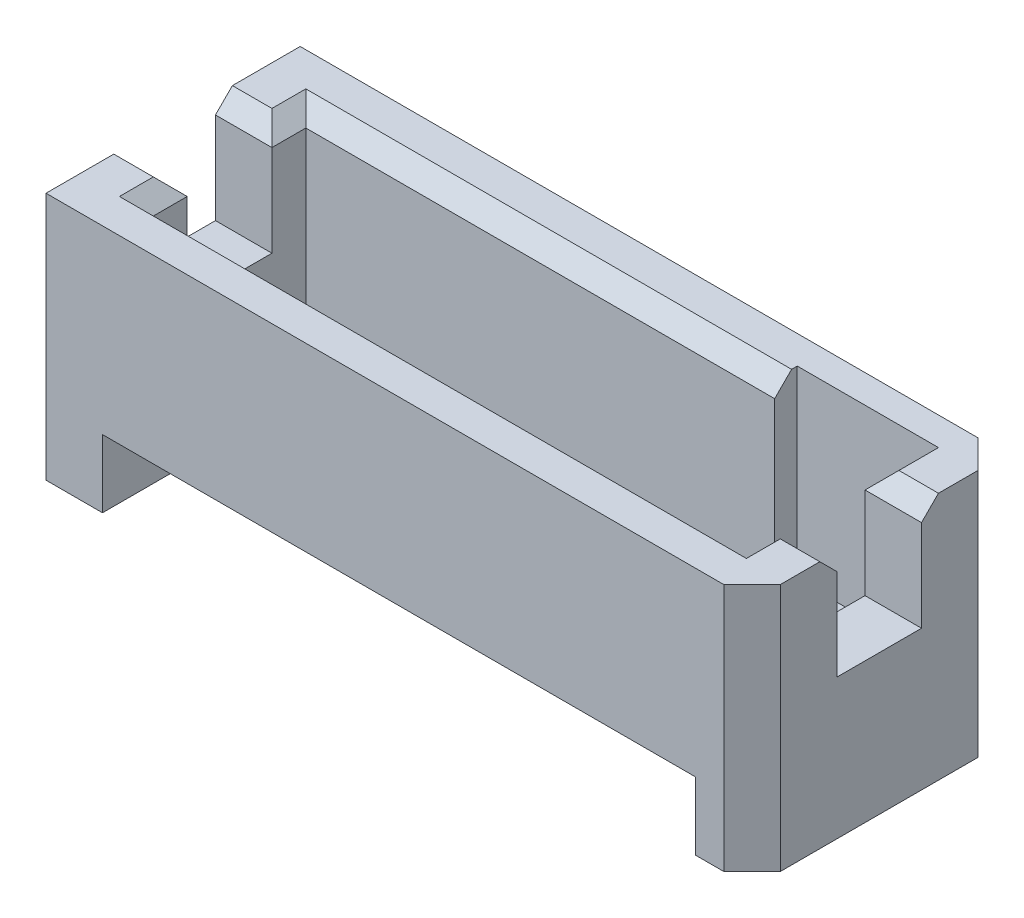
ISO-10303-21;
HEADER;
FILE_DESCRIPTION(('STEP AP214'),'2;1');
FILE_NAME('part.step','',(''),(''),'','','');
FILE_SCHEMA(('AUTOMOTIVE_DESIGN { 1 0 10303 214 1 1 1 1 }'));
ENDSEC;
DATA;
#1=APPLICATION_CONTEXT('core data for automotive mechanical design processes');
#2=APPLICATION_PROTOCOL_DEFINITION('international standard','automotive_design',2000,#1);
#3=PRODUCT_CONTEXT('',#1,'mechanical');
#4=PRODUCT('Part','Part','',(#3));
#5=PRODUCT_RELATED_PRODUCT_CATEGORY('part','',(#4));
#6=PRODUCT_DEFINITION_FORMATION('','',#4);
#7=PRODUCT_DEFINITION_CONTEXT('part definition',#1,'design');
#8=PRODUCT_DEFINITION('design','',#6,#7);
#9=PRODUCT_DEFINITION_SHAPE('','',#8);
#10=(LENGTH_UNIT() NAMED_UNIT(*) SI_UNIT(.MILLI.,.METRE.));
#11=(NAMED_UNIT(*) PLANE_ANGLE_UNIT() SI_UNIT($,.RADIAN.));
#12=(NAMED_UNIT(*) SI_UNIT($,.STERADIAN.) SOLID_ANGLE_UNIT());
#13=UNCERTAINTY_MEASURE_WITH_UNIT(LENGTH_MEASURE(1.E-05),#10,'distance_accuracy_value','');
#14=(GEOMETRIC_REPRESENTATION_CONTEXT(3) GLOBAL_UNCERTAINTY_ASSIGNED_CONTEXT((#13)) GLOBAL_UNIT_ASSIGNED_CONTEXT((#10,
#11,#12)) REPRESENTATION_CONTEXT('',''));
#15=CARTESIAN_POINT('',(0.,0.,0.));
#16=DIRECTION('',(0.,0.,1.));
#17=DIRECTION('',(1.,0.,0.));
#18=AXIS2_PLACEMENT_3D('',#15,#16,#17);
#19=CARTESIAN_POINT('',(7.3025,5.588,2.8575));
#20=DIRECTION('',(-0.707106781186547,0.,-0.707106781186548));
#21=DIRECTION('',(-0.707106781186548,0.,0.707106781186547));
#22=AXIS2_PLACEMENT_3D('',#19,#20,#21);
#23=PLANE('',#22);
#24=DIRECTION('',(0.707106781186548,0.,-0.707106781186547));
#25=VECTOR('',#24,1.);
#26=CARTESIAN_POINT('',(7.3025,0.,2.8575));
#27=LINE('',#26,#25);
#28=CARTESIAN_POINT('',(7.3025,0.,2.8575));
#29=VERTEX_POINT('',#28);
#30=CARTESIAN_POINT('',(7.9375,0.,2.2225));
#31=VERTEX_POINT('',#30);
#32=EDGE_CURVE('E11',#29,#31,#27,.T.);
#33=ORIENTED_EDGE('',*,*,#32,.T.);
#34=DIRECTION('',(0.,-1.,0.));
#35=VECTOR('',#34,1.);
#36=CARTESIAN_POINT('',(7.9375,5.588,2.2225));
#37=LINE('',#36,#35);
#38=CARTESIAN_POINT('',(7.9375,5.588,2.2225));
#39=VERTEX_POINT('',#38);
#40=EDGE_CURVE('E25',#39,#31,#37,.T.);
#41=ORIENTED_EDGE('',*,*,#40,.F.);
#42=DIRECTION('',(0.707106781186548,0.,-0.707106781186547));
#43=VECTOR('',#42,1.);
#44=CARTESIAN_POINT('',(7.3025,5.588,2.8575));
#45=LINE('',#44,#43);
#46=CARTESIAN_POINT('',(7.3025,5.588,2.8575));
#47=VERTEX_POINT('',#46);
#48=EDGE_CURVE('E661',#47,#39,#45,.T.);
#49=ORIENTED_EDGE('',*,*,#48,.F.);
#50=DIRECTION('',(0.,-1.,0.));
#51=VECTOR('',#50,1.);
#52=CARTESIAN_POINT('',(7.3025,5.588,2.8575));
#53=LINE('',#52,#51);
#54=EDGE_CURVE('E657',#47,#29,#53,.T.);
#55=ORIENTED_EDGE('',*,*,#54,.T.);
#56=EDGE_LOOP('',(#33,#41,#49,#55));
#57=FACE_BOUND('',#56,.T.);
#58=ADVANCED_FACE('F17',(#57),#23,.F.);
#59=CARTESIAN_POINT('',(-7.9375,5.588,2.8575));
#60=DIRECTION('',(0.,0.,-1.));
#61=DIRECTION('',(-1.,0.,0.));
#62=AXIS2_PLACEMENT_3D('',#59,#60,#61);
#63=PLANE('',#62);
#64=DIRECTION('',(-1.,0.,0.));
#65=VECTOR('',#64,1.);
#66=CARTESIAN_POINT('',(6.6675,1.524,2.8575));
#67=LINE('',#66,#65);
#68=CARTESIAN_POINT('',(6.6675,1.524,2.8575));
#69=VERTEX_POINT('',#68);
#70=CARTESIAN_POINT('',(-6.6675,1.524,2.8575));
#71=VERTEX_POINT('',#70);
#72=EDGE_CURVE('E652',#69,#71,#67,.T.);
#73=ORIENTED_EDGE('',*,*,#72,.F.);
#74=DIRECTION('',(0.,-1.,0.));
#75=VECTOR('',#74,1.);
#76=CARTESIAN_POINT('',(6.6675,1.524,2.8575));
#77=LINE('',#76,#75);
#78=CARTESIAN_POINT('',(6.6675,0.,2.8575));
#79=VERTEX_POINT('',#78);
#80=EDGE_CURVE('E648',#69,#79,#77,.T.);
#81=ORIENTED_EDGE('',*,*,#80,.T.);
#82=DIRECTION('',(1.,0.,0.));
#83=VECTOR('',#82,1.);
#84=CARTESIAN_POINT('',(-7.9375,0.,2.8575));
#85=LINE('',#84,#83);
#86=EDGE_CURVE('E643',#79,#29,#85,.T.);
#87=ORIENTED_EDGE('',*,*,#86,.T.);
#88=ORIENTED_EDGE('',*,*,#54,.F.);
#89=DIRECTION('',(1.,0.,0.));
#90=VECTOR('',#89,1.);
#91=CARTESIAN_POINT('',(-7.9375,5.588,2.8575));
#92=LINE('',#91,#90);
#93=CARTESIAN_POINT('',(-7.9375,5.588,2.8575));
#94=VERTEX_POINT('',#93);
#95=EDGE_CURVE('E638',#94,#47,#92,.T.);
#96=ORIENTED_EDGE('',*,*,#95,.F.);
#97=DIRECTION('',(0.,-1.,0.));
#98=VECTOR('',#97,1.);
#99=CARTESIAN_POINT('',(-7.9375,5.588,2.8575));
#100=LINE('',#99,#98);
#101=CARTESIAN_POINT('',(-7.9375,0.,2.8575));
#102=VERTEX_POINT('',#101);
#103=EDGE_CURVE('E634',#94,#102,#100,.T.);
#104=ORIENTED_EDGE('',*,*,#103,.T.);
#105=DIRECTION('',(1.,0.,0.));
#106=VECTOR('',#105,1.);
#107=CARTESIAN_POINT('',(-7.9375,0.,2.8575));
#108=LINE('',#107,#106);
#109=CARTESIAN_POINT('',(-6.6675,0.,2.8575));
#110=VERTEX_POINT('',#109);
#111=EDGE_CURVE('E630',#102,#110,#108,.T.);
#112=ORIENTED_EDGE('',*,*,#111,.T.);
#113=DIRECTION('',(0.,-1.,0.));
#114=VECTOR('',#113,1.);
#115=CARTESIAN_POINT('',(-6.6675,1.524,2.8575));
#116=LINE('',#115,#114);
#117=EDGE_CURVE('E625',#71,#110,#116,.T.);
#118=ORIENTED_EDGE('',*,*,#117,.F.);
#119=EDGE_LOOP('',(#73,#81,#87,#88,#96,#104,#112,#118));
#120=FACE_BOUND('',#119,.T.);
#121=ADVANCED_FACE('F677',(#120),#63,.F.);
#122=CARTESIAN_POINT('',(-6.6675,0.,0.));
#123=DIRECTION('',(1.,0.,0.));
#124=DIRECTION('',(0.,0.,-1.));
#125=AXIS2_PLACEMENT_3D('',#122,#123,#124);
#126=PLANE('',#125);
#127=DIRECTION('',(0.,0.496138938356834,0.868243142124459));
#128=VECTOR('',#127,1.);
#129=CARTESIAN_POINT('',(-6.6675,0.508,1.0795));
#130=LINE('',#129,#128);
#131=CARTESIAN_POINT('',(-6.6675,0.508,1.0795));
#132=VERTEX_POINT('',#131);
#133=EDGE_CURVE('E620',#132,#71,#130,.T.);
#134=ORIENTED_EDGE('',*,*,#133,.T.);
#135=ORIENTED_EDGE('',*,*,#117,.T.);
#136=DIRECTION('',(0.,0.,-1.));
#137=VECTOR('',#136,1.);
#138=CARTESIAN_POINT('',(-6.6675,0.,2.8575));
#139=LINE('',#138,#137);
#140=CARTESIAN_POINT('',(-6.6675,0.,-2.8575));
#141=VERTEX_POINT('',#140);
#142=EDGE_CURVE('E616',#110,#141,#139,.T.);
#143=ORIENTED_EDGE('',*,*,#142,.T.);
#144=DIRECTION('',(0.,1.,0.));
#145=VECTOR('',#144,1.);
#146=CARTESIAN_POINT('',(-6.6675,0.,-2.8575));
#147=LINE('',#146,#145);
#148=CARTESIAN_POINT('',(-6.6675,1.524,-2.8575));
#149=VERTEX_POINT('',#148);
#150=EDGE_CURVE('E612',#141,#149,#147,.T.);
#151=ORIENTED_EDGE('',*,*,#150,.T.);
#152=DIRECTION('',(0.,-0.496138938356834,0.868243142124459));
#153=VECTOR('',#152,1.);
#154=CARTESIAN_POINT('',(-6.6675,1.524,-2.8575));
#155=LINE('',#154,#153);
#156=CARTESIAN_POINT('',(-6.6675,0.508,-1.0795));
#157=VERTEX_POINT('',#156);
#158=EDGE_CURVE('E608',#149,#157,#155,.T.);
#159=ORIENTED_EDGE('',*,*,#158,.T.);
#160=DIRECTION('',(0.,0.,1.));
#161=VECTOR('',#160,1.);
#162=CARTESIAN_POINT('',(-6.6675,0.508,-1.0795));
#163=LINE('',#162,#161);
#164=EDGE_CURVE('E604',#157,#132,#163,.T.);
#165=ORIENTED_EDGE('',*,*,#164,.T.);
#166=EDGE_LOOP('',(#134,#135,#143,#151,#159,#165));
#167=FACE_BOUND('',#166,.T.);
#168=ADVANCED_FACE('F807',(#167),#126,.T.);
#169=CARTESIAN_POINT('',(6.6675,0.508,-1.0795));
#170=DIRECTION('',(0.,-1.,0.));
#171=DIRECTION('',(0.,0.,-1.));
#172=AXIS2_PLACEMENT_3D('',#169,#170,#171);
#173=PLANE('',#172);
#174=ORIENTED_EDGE('',*,*,#164,.F.);
#175=DIRECTION('',(-1.,0.,0.));
#176=VECTOR('',#175,1.);
#177=CARTESIAN_POINT('',(6.6675,0.508,-1.0795));
#178=LINE('',#177,#176);
#179=CARTESIAN_POINT('',(6.6675,0.508,-1.0795));
#180=VERTEX_POINT('',#179);
#181=EDGE_CURVE('E599',#180,#157,#178,.T.);
#182=ORIENTED_EDGE('',*,*,#181,.F.);
#183=DIRECTION('',(0.,0.,1.));
#184=VECTOR('',#183,1.);
#185=CARTESIAN_POINT('',(6.6675,0.508,-1.0795));
#186=LINE('',#185,#184);
#187=CARTESIAN_POINT('',(6.6675,0.508,1.0795));
#188=VERTEX_POINT('',#187);
#189=EDGE_CURVE('E595',#180,#188,#186,.T.);
#190=ORIENTED_EDGE('',*,*,#189,.T.);
#191=DIRECTION('',(-1.,0.,0.));
#192=VECTOR('',#191,1.);
#193=CARTESIAN_POINT('',(6.6675,0.508,1.0795));
#194=LINE('',#193,#192);
#195=EDGE_CURVE('E590',#188,#132,#194,.T.);
#196=ORIENTED_EDGE('',*,*,#195,.T.);
#197=EDGE_LOOP('',(#174,#182,#190,#196));
#198=FACE_BOUND('',#197,.T.);
#199=ADVANCED_FACE('F811',(#198),#173,.T.);
#200=CARTESIAN_POINT('',(6.6675,0.508,1.0795));
#201=DIRECTION('',(0.,-0.868243142124459,0.496138938356834));
#202=DIRECTION('',(0.,-0.496138938356834,-0.868243142124459));
#203=AXIS2_PLACEMENT_3D('',#200,#201,#202);
#204=PLANE('',#203);
#205=ORIENTED_EDGE('',*,*,#133,.F.);
#206=ORIENTED_EDGE('',*,*,#195,.F.);
#207=DIRECTION('',(0.,0.496138938356834,0.868243142124459));
#208=VECTOR('',#207,1.);
#209=CARTESIAN_POINT('',(6.6675,0.508,1.0795));
#210=LINE('',#209,#208);
#211=EDGE_CURVE('E585',#188,#69,#210,.T.);
#212=ORIENTED_EDGE('',*,*,#211,.T.);
#213=ORIENTED_EDGE('',*,*,#72,.T.);
#214=EDGE_LOOP('',(#205,#206,#212,#213));
#215=FACE_BOUND('',#214,.T.);
#216=ADVANCED_FACE('F817',(#215),#204,.T.);
#217=CARTESIAN_POINT('',(6.6675,0.,0.));
#218=DIRECTION('',(1.,0.,0.));
#219=DIRECTION('',(0.,0.,-1.));
#220=AXIS2_PLACEMENT_3D('',#217,#218,#219);
#221=PLANE('',#220);
#222=ORIENTED_EDGE('',*,*,#211,.F.);
#223=ORIENTED_EDGE('',*,*,#189,.F.);
#224=DIRECTION('',(0.,-0.496138938356834,0.868243142124459));
#225=VECTOR('',#224,1.);
#226=CARTESIAN_POINT('',(6.6675,1.524,-2.8575));
#227=LINE('',#226,#225);
#228=CARTESIAN_POINT('',(6.6675,1.524,-2.8575));
#229=VERTEX_POINT('',#228);
#230=EDGE_CURVE('E580',#229,#180,#227,.T.);
#231=ORIENTED_EDGE('',*,*,#230,.F.);
#232=DIRECTION('',(0.,1.,0.));
#233=VECTOR('',#232,1.);
#234=CARTESIAN_POINT('',(6.6675,0.,-2.8575));
#235=LINE('',#234,#233);
#236=CARTESIAN_POINT('',(6.6675,0.,-2.8575));
#237=VERTEX_POINT('',#236);
#238=EDGE_CURVE('E575',#237,#229,#235,.T.);
#239=ORIENTED_EDGE('',*,*,#238,.F.);
#240=DIRECTION('',(0.,0.,-1.));
#241=VECTOR('',#240,1.);
#242=CARTESIAN_POINT('',(6.6675,0.,2.8575));
#243=LINE('',#242,#241);
#244=EDGE_CURVE('E570',#79,#237,#243,.T.);
#245=ORIENTED_EDGE('',*,*,#244,.F.);
#246=ORIENTED_EDGE('',*,*,#80,.F.);
#247=EDGE_LOOP('',(#222,#223,#231,#239,#245,#246));
#248=FACE_BOUND('',#247,.T.);
#249=ADVANCED_FACE('F821',(#248),#221,.F.);
#250=CARTESIAN_POINT('',(0.,0.,0.));
#251=DIRECTION('',(0.,1.,0.));
#252=DIRECTION('',(0.,0.,1.));
#253=AXIS2_PLACEMENT_3D('',#250,#251,#252);
#254=PLANE('',#253);
#255=ORIENTED_EDGE('',*,*,#86,.F.);
#256=ORIENTED_EDGE('',*,*,#244,.T.);
#257=DIRECTION('',(-1.,0.,0.));
#258=VECTOR('',#257,1.);
#259=CARTESIAN_POINT('',(7.3025,0.,-2.8575));
#260=LINE('',#259,#258);
#261=CARTESIAN_POINT('',(7.3025,0.,-2.8575));
#262=VERTEX_POINT('',#261);
#263=EDGE_CURVE('E565',#262,#237,#260,.T.);
#264=ORIENTED_EDGE('',*,*,#263,.F.);
#265=DIRECTION('',(-0.707106781186548,0.,-0.707106781186547));
#266=VECTOR('',#265,1.);
#267=CARTESIAN_POINT('',(7.9375,0.,-2.2225));
#268=LINE('',#267,#266);
#269=CARTESIAN_POINT('',(7.9375,0.,-2.2225));
#270=VERTEX_POINT('',#269);
#271=EDGE_CURVE('E560',#270,#262,#268,.T.);
#272=ORIENTED_EDGE('',*,*,#271,.F.);
#273=DIRECTION('',(0.,0.,-1.));
#274=VECTOR('',#273,1.);
#275=CARTESIAN_POINT('',(7.9375,0.,2.2225));
#276=LINE('',#275,#274);
#277=EDGE_CURVE('E555',#31,#270,#276,.T.);
#278=ORIENTED_EDGE('',*,*,#277,.F.);
#279=ORIENTED_EDGE('',*,*,#32,.F.);
#280=EDGE_LOOP('',(#255,#256,#264,#272,#278,#279));
#281=FACE_BOUND('',#280,.T.);
#282=ADVANCED_FACE('F682',(#281),#254,.F.);
#283=CARTESIAN_POINT('',(7.9375,5.588,2.2225));
#284=DIRECTION('',(-1.,0.,0.));
#285=DIRECTION('',(0.,0.,1.));
#286=AXIS2_PLACEMENT_3D('',#283,#284,#285);
#287=PLANE('',#286);
#288=DIRECTION('',(0.,-0.707106781186548,-0.707106781186547));
#289=VECTOR('',#288,1.);
#290=CARTESIAN_POINT('',(7.9375,5.588,1.3335));
#291=LINE('',#290,#289);
#292=CARTESIAN_POINT('',(7.9375,5.588,1.3335));
#293=VERTEX_POINT('',#292);
#294=CARTESIAN_POINT('',(7.9375,5.207,0.9525));
#295=VERTEX_POINT('',#294);
#296=EDGE_CURVE('E550',#293,#295,#291,.T.);
#297=ORIENTED_EDGE('',*,*,#296,.F.);
#298=DIRECTION('',(0.,0.,-1.));
#299=VECTOR('',#298,1.);
#300=CARTESIAN_POINT('',(7.9375,5.588,2.2225));
#301=LINE('',#300,#299);
#302=EDGE_CURVE('E545',#39,#293,#301,.T.);
#303=ORIENTED_EDGE('',*,*,#302,.F.);
#304=ORIENTED_EDGE('',*,*,#40,.T.);
#305=ORIENTED_EDGE('',*,*,#277,.T.);
#306=DIRECTION('',(0.,-1.,0.));
#307=VECTOR('',#306,1.);
#308=CARTESIAN_POINT('',(7.9375,5.588,-2.2225));
#309=LINE('',#308,#307);
#310=CARTESIAN_POINT('',(7.9375,5.588,-2.2225));
#311=VERTEX_POINT('',#310);
#312=EDGE_CURVE('E540',#311,#270,#309,.T.);
#313=ORIENTED_EDGE('',*,*,#312,.F.);
#314=DIRECTION('',(0.,0.,-1.));
#315=VECTOR('',#314,1.);
#316=CARTESIAN_POINT('',(7.9375,5.588,2.2225));
#317=LINE('',#316,#315);
#318=CARTESIAN_POINT('',(7.9375,5.588,-1.3335));
#319=VERTEX_POINT('',#318);
#320=EDGE_CURVE('E535',#319,#311,#317,.T.);
#321=ORIENTED_EDGE('',*,*,#320,.F.);
#322=DIRECTION('',(0.,0.707106781186548,-0.707106781186547));
#323=VECTOR('',#322,1.);
#324=CARTESIAN_POINT('',(7.9375,5.207,-0.9525));
#325=LINE('',#324,#323);
#326=CARTESIAN_POINT('',(7.9375,5.207,-0.9525));
#327=VERTEX_POINT('',#326);
#328=EDGE_CURVE('E530',#327,#319,#325,.T.);
#329=ORIENTED_EDGE('',*,*,#328,.F.);
#330=DIRECTION('',(0.,-1.,0.));
#331=VECTOR('',#330,1.);
#332=CARTESIAN_POINT('',(7.9375,8.0264,-0.9525));
#333=LINE('',#332,#331);
#334=CARTESIAN_POINT('',(7.9375,3.1496,-0.9525));
#335=VERTEX_POINT('',#334);
#336=EDGE_CURVE('E526',#327,#335,#333,.T.);
#337=ORIENTED_EDGE('',*,*,#336,.T.);
#338=DIRECTION('',(0.,0.,-1.));
#339=VECTOR('',#338,1.);
#340=CARTESIAN_POINT('',(7.9375,3.1496,0.9525));
#341=LINE('',#340,#339);
#342=CARTESIAN_POINT('',(7.9375,3.1496,0.9525));
#343=VERTEX_POINT('',#342);
#344=EDGE_CURVE('E521',#343,#335,#341,.T.);
#345=ORIENTED_EDGE('',*,*,#344,.F.);
#346=DIRECTION('',(0.,-1.,0.));
#347=VECTOR('',#346,1.);
#348=CARTESIAN_POINT('',(7.9375,8.0264,0.9525));
#349=LINE('',#348,#347);
#350=EDGE_CURVE('E516',#295,#343,#349,.T.);
#351=ORIENTED_EDGE('',*,*,#350,.F.);
#352=EDGE_LOOP('',(#297,#303,#304,#305,#313,#321,#329,#337,#345,#351));
#353=FACE_BOUND('',#352,.T.);
#354=ADVANCED_FACE('F671',(#353),#287,.F.);
#355=CARTESIAN_POINT('',(-7.9375,8.0264,0.9525));
#356=DIRECTION('',(0.,0.,-1.));
#357=DIRECTION('',(-1.,0.,0.));
#358=AXIS2_PLACEMENT_3D('',#355,#356,#357);
#359=PLANE('',#358);
#360=DIRECTION('',(0.,-1.,0.));
#361=VECTOR('',#360,1.);
#362=CARTESIAN_POINT('',(6.6675,8.0264,0.9525));
#363=LINE('',#362,#361);
#364=CARTESIAN_POINT('',(6.6675,5.207,0.9525));
#365=VERTEX_POINT('',#364);
#366=CARTESIAN_POINT('',(6.6675,3.1496,0.9525));
#367=VERTEX_POINT('',#366);
#368=EDGE_CURVE('E511',#365,#367,#363,.T.);
#369=ORIENTED_EDGE('',*,*,#368,.F.);
#370=DIRECTION('',(-1.,0.,0.));
#371=VECTOR('',#370,1.);
#372=CARTESIAN_POINT('',(7.9375,5.207,0.9525));
#373=LINE('',#372,#371);
#374=EDGE_CURVE('E506',#295,#365,#373,.T.);
#375=ORIENTED_EDGE('',*,*,#374,.F.);
#376=ORIENTED_EDGE('',*,*,#350,.T.);
#377=DIRECTION('',(1.,0.,0.));
#378=VECTOR('',#377,1.);
#379=CARTESIAN_POINT('',(-7.9375,3.1496,0.9525));
#380=LINE('',#379,#378);
#381=EDGE_CURVE('E501',#367,#343,#380,.T.);
#382=ORIENTED_EDGE('',*,*,#381,.F.);
#383=EDGE_LOOP('',(#369,#375,#376,#382));
#384=FACE_BOUND('',#383,.T.);
#385=ADVANCED_FACE('F791',(#384),#359,.T.);
#386=CARTESIAN_POINT('',(0.,3.1496,0.));
#387=DIRECTION('',(0.,1.,0.));
#388=DIRECTION('',(0.,0.,1.));
#389=AXIS2_PLACEMENT_3D('',#386,#387,#388);
#390=PLANE('',#389);
#391=DIRECTION('',(0.,0.,-1.));
#392=VECTOR('',#391,1.);
#393=CARTESIAN_POINT('',(6.6675,3.1496,0.));
#394=LINE('',#393,#392);
#395=CARTESIAN_POINT('',(6.6675,3.1496,-0.9525));
#396=VERTEX_POINT('',#395);
#397=EDGE_CURVE('E496',#367,#396,#394,.T.);
#398=ORIENTED_EDGE('',*,*,#397,.F.);
#399=ORIENTED_EDGE('',*,*,#381,.T.);
#400=ORIENTED_EDGE('',*,*,#344,.T.);
#401=DIRECTION('',(-1.,0.,0.));
#402=VECTOR('',#401,1.);
#403=CARTESIAN_POINT('',(7.9375,3.1496,-0.9525));
#404=LINE('',#403,#402);
#405=EDGE_CURVE('E492',#335,#396,#404,.T.);
#406=ORIENTED_EDGE('',*,*,#405,.T.);
#407=EDGE_LOOP('',(#398,#399,#400,#406));
#408=FACE_BOUND('',#407,.T.);
#409=ADVANCED_FACE('F793',(#408),#390,.T.);
#410=CARTESIAN_POINT('',(7.9375,8.0264,-0.9525));
#411=DIRECTION('',(0.,0.,1.));
#412=DIRECTION('',(1.,0.,0.));
#413=AXIS2_PLACEMENT_3D('',#410,#411,#412);
#414=PLANE('',#413);
#415=ORIENTED_EDGE('',*,*,#336,.F.);
#416=DIRECTION('',(-1.,0.,0.));
#417=VECTOR('',#416,1.);
#418=CARTESIAN_POINT('',(7.9375,5.207,-0.9525));
#419=LINE('',#418,#417);
#420=CARTESIAN_POINT('',(6.6675,5.207,-0.9525));
#421=VERTEX_POINT('',#420);
#422=EDGE_CURVE('E488',#327,#421,#419,.T.);
#423=ORIENTED_EDGE('',*,*,#422,.T.);
#424=DIRECTION('',(0.,1.,0.));
#425=VECTOR('',#424,1.);
#426=CARTESIAN_POINT('',(6.6675,8.0264,-0.9525));
#427=LINE('',#426,#425);
#428=EDGE_CURVE('E483',#396,#421,#427,.T.);
#429=ORIENTED_EDGE('',*,*,#428,.F.);
#430=ORIENTED_EDGE('',*,*,#405,.F.);
#431=EDGE_LOOP('',(#415,#423,#429,#430));
#432=FACE_BOUND('',#431,.T.);
#433=ADVANCED_FACE('F698',(#432),#414,.T.);
#434=CARTESIAN_POINT('',(6.6675,1.4351,1.7145));
#435=DIRECTION('',(1.,0.,0.));
#436=DIRECTION('',(0.,0.,-1.));
#437=AXIS2_PLACEMENT_3D('',#434,#435,#436);
#438=PLANE('',#437);
#439=ORIENTED_EDGE('',*,*,#397,.T.);
#440=ORIENTED_EDGE('',*,*,#428,.T.);
#441=DIRECTION('',(0.,0.,-1.));
#442=VECTOR('',#441,1.);
#443=CARTESIAN_POINT('',(6.6675,5.207,1.7145));
#444=LINE('',#443,#442);
#445=CARTESIAN_POINT('',(6.6675,5.207,-2.2225));
#446=VERTEX_POINT('',#445);
#447=EDGE_CURVE('E479',#421,#446,#444,.T.);
#448=ORIENTED_EDGE('',*,*,#447,.T.);
#449=DIRECTION('',(0.,1.,0.));
#450=VECTOR('',#449,1.);
#451=CARTESIAN_POINT('',(6.6675,1.4351,-2.2225));
#452=LINE('',#451,#450);
#453=CARTESIAN_POINT('',(6.6675,1.4351,-2.2225));
#454=VERTEX_POINT('',#453);
#455=EDGE_CURVE('E475',#454,#446,#452,.T.);
#456=ORIENTED_EDGE('',*,*,#455,.F.);
#457=DIRECTION('',(0.,0.,-1.));
#458=VECTOR('',#457,1.);
#459=CARTESIAN_POINT('',(6.6675,1.4351,1.7145));
#460=LINE('',#459,#458);
#461=CARTESIAN_POINT('',(6.6675,1.4351,1.7145));
#462=VERTEX_POINT('',#461);
#463=EDGE_CURVE('E233',#462,#454,#460,.T.);
#464=ORIENTED_EDGE('',*,*,#463,.F.);
#465=DIRECTION('',(0.,1.,0.));
#466=VECTOR('',#465,1.);
#467=CARTESIAN_POINT('',(6.6675,1.4351,1.7145));
#468=LINE('',#467,#466);
#469=CARTESIAN_POINT('',(6.6675,5.207,1.7145));
#470=VERTEX_POINT('',#469);
#471=EDGE_CURVE('E468',#462,#470,#468,.T.);
#472=ORIENTED_EDGE('',*,*,#471,.T.);
#473=DIRECTION('',(0.,0.,-1.));
#474=VECTOR('',#473,1.);
#475=CARTESIAN_POINT('',(6.6675,5.207,1.7145));
#476=LINE('',#475,#474);
#477=EDGE_CURVE('E463',#470,#365,#476,.T.);
#478=ORIENTED_EDGE('',*,*,#477,.T.);
#479=ORIENTED_EDGE('',*,*,#368,.T.);
#480=EDGE_LOOP('',(#439,#440,#448,#456,#464,#472,#478,#479));
#481=FACE_BOUND('',#480,.T.);
#482=ADVANCED_FACE('F702',(#481),#438,.F.);
#483=CARTESIAN_POINT('',(6.6675,5.207,1.7145));
#484=DIRECTION('',(-0.707106781186548,0.707106781186548,0.));
#485=DIRECTION('',(-0.707106781186548,-0.707106781186548,0.));
#486=AXIS2_PLACEMENT_3D('',#483,#484,#485);
#487=PLANE('',#486);
#488=DIRECTION('',(0.,0.,-1.));
#489=VECTOR('',#488,1.);
#490=CARTESIAN_POINT('',(7.0485,5.588,1.7145));
#491=LINE('',#490,#489);
#492=CARTESIAN_POINT('',(7.0485,5.588,2.0955));
#493=VERTEX_POINT('',#492);
#494=CARTESIAN_POINT('',(7.0485,5.588,1.3335));
#495=VERTEX_POINT('',#494);
#496=EDGE_CURVE('E459',#493,#495,#491,.T.);
#497=ORIENTED_EDGE('',*,*,#496,.T.);
#498=DIRECTION('',(-0.577350269189626,-0.577350269189626,-0.577350269189625));
#499=VECTOR('',#498,1.);
#500=CARTESIAN_POINT('',(6.9215,5.461,1.2065));
#501=LINE('',#500,#499);
#502=EDGE_CURVE('E454',#495,#365,#501,.T.);
#503=ORIENTED_EDGE('',*,*,#502,.T.);
#504=ORIENTED_EDGE('',*,*,#477,.F.);
#505=DIRECTION('',(-0.577350269189626,-0.577350269189626,-0.577350269189626));
#506=VECTOR('',#505,1.);
#507=CARTESIAN_POINT('',(6.6675,5.207,1.7145));
#508=LINE('',#507,#506);
#509=EDGE_CURVE('E449',#493,#470,#508,.T.);
#510=ORIENTED_EDGE('',*,*,#509,.F.);
#511=EDGE_LOOP('',(#497,#503,#504,#510));
#512=FACE_BOUND('',#511,.T.);
#513=ADVANCED_FACE('F788',(#512),#487,.T.);
#514=CARTESIAN_POINT('',(-6.6675,5.207,1.7145));
#515=DIRECTION('',(0.,0.707106781186548,-0.707106781186547));
#516=DIRECTION('',(0.,0.707106781186547,0.707106781186548));
#517=AXIS2_PLACEMENT_3D('',#514,#515,#516);
#518=PLANE('',#517);
#519=DIRECTION('',(1.,0.,0.));
#520=VECTOR('',#519,1.);
#521=CARTESIAN_POINT('',(-6.6675,5.207,1.7145));
#522=LINE('',#521,#520);
#523=CARTESIAN_POINT('',(-6.6675,5.207,1.7145));
#524=VERTEX_POINT('',#523);
#525=EDGE_CURVE('E444',#524,#470,#522,.T.);
#526=ORIENTED_EDGE('',*,*,#525,.F.);
#527=DIRECTION('',(0.577350269189626,-0.577350269189626,-0.577350269189626));
#528=VECTOR('',#527,1.);
#529=CARTESIAN_POINT('',(-6.6675,5.207,1.7145));
#530=LINE('',#529,#528);
#531=CARTESIAN_POINT('',(-7.0485,5.588,2.0955));
#532=VERTEX_POINT('',#531);
#533=EDGE_CURVE('E439',#532,#524,#530,.T.);
#534=ORIENTED_EDGE('',*,*,#533,.F.);
#535=DIRECTION('',(1.,0.,0.));
#536=VECTOR('',#535,1.);
#537=CARTESIAN_POINT('',(-6.6675,5.588,2.0955));
#538=LINE('',#537,#536);
#539=EDGE_CURVE('E434',#532,#493,#538,.T.);
#540=ORIENTED_EDGE('',*,*,#539,.T.);
#541=ORIENTED_EDGE('',*,*,#509,.T.);
#542=EDGE_LOOP('',(#526,#534,#540,#541));
#543=FACE_BOUND('',#542,.T.);
#544=ADVANCED_FACE('F714',(#543),#518,.T.);
#545=CARTESIAN_POINT('',(0.,5.588,0.));
#546=DIRECTION('',(0.,1.,0.));
#547=DIRECTION('',(0.,0.,1.));
#548=AXIS2_PLACEMENT_3D('',#545,#546,#547);
#549=PLANE('',#548);
#550=ORIENTED_EDGE('',*,*,#302,.T.);
#551=DIRECTION('',(-1.,0.,0.));
#552=VECTOR('',#551,1.);
#553=CARTESIAN_POINT('',(7.9375,5.588,1.3335));
#554=LINE('',#553,#552);
#555=EDGE_CURVE('E429',#293,#495,#554,.T.);
#556=ORIENTED_EDGE('',*,*,#555,.T.);
#557=ORIENTED_EDGE('',*,*,#496,.F.);
#558=ORIENTED_EDGE('',*,*,#539,.F.);
#559=DIRECTION('',(0.,0.,1.));
#560=VECTOR('',#559,1.);
#561=CARTESIAN_POINT('',(-7.0485,5.588,-1.7145));
#562=LINE('',#561,#560);
#563=CARTESIAN_POINT('',(-7.0485,5.588,1.3335));
#564=VERTEX_POINT('',#563);
#565=EDGE_CURVE('E424',#564,#532,#562,.T.);
#566=ORIENTED_EDGE('',*,*,#565,.F.);
#567=DIRECTION('',(-1.,0.,0.));
#568=VECTOR('',#567,1.);
#569=CARTESIAN_POINT('',(7.9375,5.588,1.3335));
#570=LINE('',#569,#568);
#571=CARTESIAN_POINT('',(-7.9375,5.588,1.3335));
#572=VERTEX_POINT('',#571);
#573=EDGE_CURVE('E420',#564,#572,#570,.T.);
#574=ORIENTED_EDGE('',*,*,#573,.T.);
#575=DIRECTION('',(0.,0.,1.));
#576=VECTOR('',#575,1.);
#577=CARTESIAN_POINT('',(-7.9375,5.588,-2.8575));
#578=LINE('',#577,#576);
#579=EDGE_CURVE('E415',#572,#94,#578,.T.);
#580=ORIENTED_EDGE('',*,*,#579,.T.);
#581=ORIENTED_EDGE('',*,*,#95,.T.);
#582=ORIENTED_EDGE('',*,*,#48,.T.);
#583=EDGE_LOOP('',(#550,#556,#557,#558,#566,#574,#580,#581,#582));
#584=FACE_BOUND('',#583,.T.);
#585=ADVANCED_FACE('F674',(#584),#549,.T.);
#586=CARTESIAN_POINT('',(-7.9375,5.588,-2.8575));
#587=DIRECTION('',(1.,0.,0.));
#588=DIRECTION('',(0.,0.,-1.));
#589=AXIS2_PLACEMENT_3D('',#586,#587,#588);
#590=PLANE('',#589);
#591=DIRECTION('',(0.,-0.707106781186548,-0.707106781186547));
#592=VECTOR('',#591,1.);
#593=CARTESIAN_POINT('',(-7.9375,5.588,1.3335));
#594=LINE('',#593,#592);
#595=CARTESIAN_POINT('',(-7.9375,5.207,0.9525));
#596=VERTEX_POINT('',#595);
#597=EDGE_CURVE('E411',#572,#596,#594,.T.);
#598=ORIENTED_EDGE('',*,*,#597,.T.);
#599=DIRECTION('',(0.,-1.,0.));
#600=VECTOR('',#599,1.);
#601=CARTESIAN_POINT('',(-7.9375,8.0264,0.9525));
#602=LINE('',#601,#600);
#603=CARTESIAN_POINT('',(-7.9375,3.1496,0.9525));
#604=VERTEX_POINT('',#603);
#605=EDGE_CURVE('E407',#596,#604,#602,.T.);
#606=ORIENTED_EDGE('',*,*,#605,.T.);
#607=DIRECTION('',(0.,0.,1.));
#608=VECTOR('',#607,1.);
#609=CARTESIAN_POINT('',(-7.9375,3.1496,-0.9525));
#610=LINE('',#609,#608);
#611=CARTESIAN_POINT('',(-7.9375,3.1496,-0.9525));
#612=VERTEX_POINT('',#611);
#613=EDGE_CURVE('E402',#612,#604,#610,.T.);
#614=ORIENTED_EDGE('',*,*,#613,.F.);
#615=DIRECTION('',(0.,-1.,0.));
#616=VECTOR('',#615,1.);
#617=CARTESIAN_POINT('',(-7.9375,8.0264,-0.9525));
#618=LINE('',#617,#616);
#619=CARTESIAN_POINT('',(-7.9375,5.207,-0.9525));
#620=VERTEX_POINT('',#619);
#621=EDGE_CURVE('E397',#620,#612,#618,.T.);
#622=ORIENTED_EDGE('',*,*,#621,.F.);
#623=DIRECTION('',(0.,0.707106781186548,-0.707106781186547));
#624=VECTOR('',#623,1.);
#625=CARTESIAN_POINT('',(-7.9375,5.207,-0.9525));
#626=LINE('',#625,#624);
#627=CARTESIAN_POINT('',(-7.9375,5.588,-1.3335));
#628=VERTEX_POINT('',#627);
#629=EDGE_CURVE('E393',#620,#628,#626,.T.);
#630=ORIENTED_EDGE('',*,*,#629,.T.);
#631=DIRECTION('',(0.,0.,1.));
#632=VECTOR('',#631,1.);
#633=CARTESIAN_POINT('',(-7.9375,5.588,-2.8575));
#634=LINE('',#633,#632);
#635=CARTESIAN_POINT('',(-7.9375,5.588,-2.8575));
#636=VERTEX_POINT('',#635);
#637=EDGE_CURVE('E388',#636,#628,#634,.T.);
#638=ORIENTED_EDGE('',*,*,#637,.F.);
#639=DIRECTION('',(0.,-1.,0.));
#640=VECTOR('',#639,1.);
#641=CARTESIAN_POINT('',(-7.9375,5.588,-2.8575));
#642=LINE('',#641,#640);
#643=CARTESIAN_POINT('',(-7.9375,0.,-2.8575));
#644=VERTEX_POINT('',#643);
#645=EDGE_CURVE('E384',#636,#644,#642,.T.);
#646=ORIENTED_EDGE('',*,*,#645,.T.);
#647=DIRECTION('',(0.,0.,1.));
#648=VECTOR('',#647,1.);
#649=CARTESIAN_POINT('',(-7.9375,0.,-2.8575));
#650=LINE('',#649,#648);
#651=EDGE_CURVE('E379',#644,#102,#650,.T.);
#652=ORIENTED_EDGE('',*,*,#651,.T.);
#653=ORIENTED_EDGE('',*,*,#103,.F.);
#654=ORIENTED_EDGE('',*,*,#579,.F.);
#655=EDGE_LOOP('',(#598,#606,#614,#622,#630,#638,#646,#652,#653,#654));
#656=FACE_BOUND('',#655,.T.);
#657=ADVANCED_FACE('F782',(#656),#590,.F.);
#658=CARTESIAN_POINT('',(0.,0.,0.));
#659=DIRECTION('',(0.,1.,0.));
#660=DIRECTION('',(0.,0.,1.));
#661=AXIS2_PLACEMENT_3D('',#658,#659,#660);
#662=PLANE('',#661);
#663=ORIENTED_EDGE('',*,*,#142,.F.);
#664=ORIENTED_EDGE('',*,*,#111,.F.);
#665=ORIENTED_EDGE('',*,*,#651,.F.);
#666=DIRECTION('',(-1.,0.,0.));
#667=VECTOR('',#666,1.);
#668=CARTESIAN_POINT('',(7.3025,0.,-2.8575));
#669=LINE('',#668,#667);
#670=EDGE_CURVE('E374',#141,#644,#669,.T.);
#671=ORIENTED_EDGE('',*,*,#670,.F.);
#672=EDGE_LOOP('',(#663,#664,#665,#671));
#673=FACE_BOUND('',#672,.T.);
#674=ADVANCED_FACE('F892',(#673),#662,.F.);
#675=CARTESIAN_POINT('',(7.3025,5.588,-2.8575));
#676=DIRECTION('',(0.,0.,1.));
#677=DIRECTION('',(1.,0.,0.));
#678=AXIS2_PLACEMENT_3D('',#675,#676,#677);
#679=PLANE('',#678);
#680=ORIENTED_EDGE('',*,*,#263,.T.);
#681=ORIENTED_EDGE('',*,*,#238,.T.);
#682=DIRECTION('',(-1.,0.,0.));
#683=VECTOR('',#682,1.);
#684=CARTESIAN_POINT('',(6.6675,1.524,-2.8575));
#685=LINE('',#684,#683);
#686=EDGE_CURVE('E369',#229,#149,#685,.T.);
#687=ORIENTED_EDGE('',*,*,#686,.T.);
#688=ORIENTED_EDGE('',*,*,#150,.F.);
#689=ORIENTED_EDGE('',*,*,#670,.T.);
#690=ORIENTED_EDGE('',*,*,#645,.F.);
#691=DIRECTION('',(-1.,0.,0.));
#692=VECTOR('',#691,1.);
#693=CARTESIAN_POINT('',(7.3025,5.588,-2.8575));
#694=LINE('',#693,#692);
#695=CARTESIAN_POINT('',(7.3025,5.588,-2.8575));
#696=VERTEX_POINT('',#695);
#697=EDGE_CURVE('E364',#696,#636,#694,.T.);
#698=ORIENTED_EDGE('',*,*,#697,.F.);
#699=DIRECTION('',(0.,-1.,0.));
#700=VECTOR('',#699,1.);
#701=CARTESIAN_POINT('',(7.3025,5.588,-2.8575));
#702=LINE('',#701,#700);
#703=EDGE_CURVE('E359',#696,#262,#702,.T.);
#704=ORIENTED_EDGE('',*,*,#703,.T.);
#705=EDGE_LOOP('',(#680,#681,#687,#688,#689,#690,#698,#704));
#706=FACE_BOUND('',#705,.T.);
#707=ADVANCED_FACE('F901',(#706),#679,.F.);
#708=CARTESIAN_POINT('',(7.9375,5.588,-2.2225));
#709=DIRECTION('',(-0.707106781186547,0.,0.707106781186548));
#710=DIRECTION('',(0.707106781186548,0.,0.707106781186547));
#711=AXIS2_PLACEMENT_3D('',#708,#709,#710);
#712=PLANE('',#711);
#713=ORIENTED_EDGE('',*,*,#271,.T.);
#714=ORIENTED_EDGE('',*,*,#703,.F.);
#715=DIRECTION('',(-0.707106781186548,0.,-0.707106781186547));
#716=VECTOR('',#715,1.);
#717=CARTESIAN_POINT('',(7.9375,5.588,-2.2225));
#718=LINE('',#717,#716);
#719=EDGE_CURVE('E354',#311,#696,#718,.T.);
#720=ORIENTED_EDGE('',*,*,#719,.F.);
#721=ORIENTED_EDGE('',*,*,#312,.T.);
#722=EDGE_LOOP('',(#713,#714,#720,#721));
#723=FACE_BOUND('',#722,.T.);
#724=ADVANCED_FACE('F685',(#723),#712,.F.);
#725=CARTESIAN_POINT('',(0.,5.588,0.));
#726=DIRECTION('',(0.,1.,0.));
#727=DIRECTION('',(0.,0.,1.));
#728=AXIS2_PLACEMENT_3D('',#725,#726,#727);
#729=PLANE('',#728);
#730=DIRECTION('',(0.,0.,1.));
#731=VECTOR('',#730,1.);
#732=CARTESIAN_POINT('',(3.8735,5.588,-2.2225));
#733=LINE('',#732,#731);
#734=CARTESIAN_POINT('',(3.8735,5.588,-2.2225));
#735=VERTEX_POINT('',#734);
#736=CARTESIAN_POINT('',(3.8735,5.588,-2.0955));
#737=VERTEX_POINT('',#736);
#738=EDGE_CURVE('E350',#735,#737,#733,.T.);
#739=ORIENTED_EDGE('',*,*,#738,.F.);
#740=DIRECTION('',(-1.,0.,0.));
#741=VECTOR('',#740,1.);
#742=CARTESIAN_POINT('',(7.0485,5.588,-2.2225));
#743=LINE('',#742,#741);
#744=CARTESIAN_POINT('',(7.0485,5.588,-2.2225));
#745=VERTEX_POINT('',#744);
#746=EDGE_CURVE('E252',#745,#735,#743,.T.);
#747=ORIENTED_EDGE('',*,*,#746,.F.);
#748=DIRECTION('',(0.,0.,-1.));
#749=VECTOR('',#748,1.);
#750=CARTESIAN_POINT('',(7.0485,5.588,1.7145));
#751=LINE('',#750,#749);
#752=CARTESIAN_POINT('',(7.0485,5.588,-1.3335));
#753=VERTEX_POINT('',#752);
#754=EDGE_CURVE('E342',#753,#745,#751,.T.);
#755=ORIENTED_EDGE('',*,*,#754,.F.);
#756=DIRECTION('',(-1.,0.,0.));
#757=VECTOR('',#756,1.);
#758=CARTESIAN_POINT('',(7.9375,5.588,-1.3335));
#759=LINE('',#758,#757);
#760=EDGE_CURVE('E337',#319,#753,#759,.T.);
#761=ORIENTED_EDGE('',*,*,#760,.F.);
#762=ORIENTED_EDGE('',*,*,#320,.T.);
#763=ORIENTED_EDGE('',*,*,#719,.T.);
#764=ORIENTED_EDGE('',*,*,#697,.T.);
#765=ORIENTED_EDGE('',*,*,#637,.T.);
#766=DIRECTION('',(-1.,0.,0.));
#767=VECTOR('',#766,1.);
#768=CARTESIAN_POINT('',(7.9375,5.588,-1.3335));
#769=LINE('',#768,#767);
#770=CARTESIAN_POINT('',(-7.0485,5.588,-1.3335));
#771=VERTEX_POINT('',#770);
#772=EDGE_CURVE('E332',#771,#628,#769,.T.);
#773=ORIENTED_EDGE('',*,*,#772,.F.);
#774=DIRECTION('',(0.,0.,1.));
#775=VECTOR('',#774,1.);
#776=CARTESIAN_POINT('',(-7.0485,5.588,-1.7145));
#777=LINE('',#776,#775);
#778=CARTESIAN_POINT('',(-7.0485,5.588,-2.0955));
#779=VERTEX_POINT('',#778);
#780=EDGE_CURVE('E327',#779,#771,#777,.T.);
#781=ORIENTED_EDGE('',*,*,#780,.F.);
#782=DIRECTION('',(-1.,0.,0.));
#783=VECTOR('',#782,1.);
#784=CARTESIAN_POINT('',(6.6675,5.588,-2.0955));
#785=LINE('',#784,#783);
#786=EDGE_CURVE('E322',#737,#779,#785,.T.);
#787=ORIENTED_EDGE('',*,*,#786,.F.);
#788=EDGE_LOOP('',(#739,#747,#755,#761,#762,#763,#764,#765,#773,#781,#787));
#789=FACE_BOUND('',#788,.T.);
#790=ADVANCED_FACE('F690',(#789),#729,.T.);
#791=CARTESIAN_POINT('',(6.6675,5.207,-1.7145));
#792=DIRECTION('',(0.,0.707106781186548,0.707106781186547));
#793=DIRECTION('',(0.,-0.707106781186547,0.707106781186548));
#794=AXIS2_PLACEMENT_3D('',#791,#792,#793);
#795=PLANE('',#794);
#796=DIRECTION('',(0.,-0.707106781186547,0.707106781186548));
#797=VECTOR('',#796,1.);
#798=CARTESIAN_POINT('',(3.8735,5.207,-1.7145));
#799=LINE('',#798,#797);
#800=CARTESIAN_POINT('',(3.8735,5.207,-1.7145));
#801=VERTEX_POINT('',#800);
#802=EDGE_CURVE('E318',#737,#801,#799,.T.);
#803=ORIENTED_EDGE('',*,*,#802,.F.);
#804=ORIENTED_EDGE('',*,*,#786,.T.);
#805=DIRECTION('',(0.577350269189626,-0.577350269189626,0.577350269189626));
#806=VECTOR('',#805,1.);
#807=CARTESIAN_POINT('',(-6.6675,5.207,-1.7145));
#808=LINE('',#807,#806);
#809=CARTESIAN_POINT('',(-6.6675,5.207,-1.7145));
#810=VERTEX_POINT('',#809);
#811=EDGE_CURVE('E314',#779,#810,#808,.T.);
#812=ORIENTED_EDGE('',*,*,#811,.T.);
#813=DIRECTION('',(-1.,0.,0.));
#814=VECTOR('',#813,1.);
#815=CARTESIAN_POINT('',(6.6675,5.207,-1.7145));
#816=LINE('',#815,#814);
#817=EDGE_CURVE('E309',#801,#810,#816,.T.);
#818=ORIENTED_EDGE('',*,*,#817,.F.);
#819=EDGE_LOOP('',(#803,#804,#812,#818));
#820=FACE_BOUND('',#819,.T.);
#821=ADVANCED_FACE('F928',(#820),#795,.T.);
#822=CARTESIAN_POINT('',(6.6675,1.4351,-1.7145));
#823=DIRECTION('',(0.,0.,-1.));
#824=DIRECTION('',(-1.,0.,0.));
#825=AXIS2_PLACEMENT_3D('',#822,#823,#824);
#826=PLANE('',#825);
#827=DIRECTION('',(-1.,0.,0.));
#828=VECTOR('',#827,1.);
#829=CARTESIAN_POINT('',(6.6675,1.4351,-1.7145));
#830=LINE('',#829,#828);
#831=CARTESIAN_POINT('',(3.8735,1.4351,-1.7145));
#832=VERTEX_POINT('',#831);
#833=CARTESIAN_POINT('',(-6.6675,1.4351,-1.7145));
#834=VERTEX_POINT('',#833);
#835=EDGE_CURVE('E305',#832,#834,#830,.T.);
#836=ORIENTED_EDGE('',*,*,#835,.F.);
#837=DIRECTION('',(0.,1.,0.));
#838=VECTOR('',#837,1.);
#839=CARTESIAN_POINT('',(3.8735,1.4351,-1.7145));
#840=LINE('',#839,#838);
#841=EDGE_CURVE('E247',#832,#801,#840,.T.);
#842=ORIENTED_EDGE('',*,*,#841,.T.);
#843=ORIENTED_EDGE('',*,*,#817,.T.);
#844=DIRECTION('',(0.,1.,0.));
#845=VECTOR('',#844,1.);
#846=CARTESIAN_POINT('',(-6.6675,1.4351,-1.7145));
#847=LINE('',#846,#845);
#848=EDGE_CURVE('E297',#834,#810,#847,.T.);
#849=ORIENTED_EDGE('',*,*,#848,.F.);
#850=EDGE_LOOP('',(#836,#842,#843,#849));
#851=FACE_BOUND('',#850,.T.);
#852=ADVANCED_FACE('F937',(#851),#826,.F.);
#853=CARTESIAN_POINT('',(-6.6675,1.4351,-1.7145));
#854=DIRECTION('',(-1.,0.,0.));
#855=DIRECTION('',(0.,0.,1.));
#856=AXIS2_PLACEMENT_3D('',#853,#854,#855);
#857=PLANE('',#856);
#858=DIRECTION('',(0.,0.,1.));
#859=VECTOR('',#858,1.);
#860=CARTESIAN_POINT('',(-6.6675,5.207,-1.7145));
#861=LINE('',#860,#859);
#862=CARTESIAN_POINT('',(-6.6675,5.207,-0.9525));
#863=VERTEX_POINT('',#862);
#864=EDGE_CURVE('E293',#810,#863,#861,.T.);
#865=ORIENTED_EDGE('',*,*,#864,.T.);
#866=DIRECTION('',(0.,-1.,0.));
#867=VECTOR('',#866,1.);
#868=CARTESIAN_POINT('',(-6.6675,8.0264,-0.9525));
#869=LINE('',#868,#867);
#870=CARTESIAN_POINT('',(-6.6675,3.1496,-0.9525));
#871=VERTEX_POINT('',#870);
#872=EDGE_CURVE('E289',#863,#871,#869,.T.);
#873=ORIENTED_EDGE('',*,*,#872,.T.);
#874=DIRECTION('',(0.,0.,1.));
#875=VECTOR('',#874,1.);
#876=CARTESIAN_POINT('',(-6.6675,3.1496,0.));
#877=LINE('',#876,#875);
#878=CARTESIAN_POINT('',(-6.6675,3.1496,0.9525));
#879=VERTEX_POINT('',#878);
#880=EDGE_CURVE('E285',#871,#879,#877,.T.);
#881=ORIENTED_EDGE('',*,*,#880,.T.);
#882=DIRECTION('',(0.,1.,0.));
#883=VECTOR('',#882,1.);
#884=CARTESIAN_POINT('',(-6.6675,8.0264,0.9525));
#885=LINE('',#884,#883);
#886=CARTESIAN_POINT('',(-6.6675,5.207,0.9525));
#887=VERTEX_POINT('',#886);
#888=EDGE_CURVE('E281',#879,#887,#885,.T.);
#889=ORIENTED_EDGE('',*,*,#888,.T.);
#890=DIRECTION('',(0.,0.,1.));
#891=VECTOR('',#890,1.);
#892=CARTESIAN_POINT('',(-6.6675,5.207,-1.7145));
#893=LINE('',#892,#891);
#894=EDGE_CURVE('E276',#887,#524,#893,.T.);
#895=ORIENTED_EDGE('',*,*,#894,.T.);
#896=DIRECTION('',(0.,1.,0.));
#897=VECTOR('',#896,1.);
#898=CARTESIAN_POINT('',(-6.6675,1.4351,1.7145));
#899=LINE('',#898,#897);
#900=CARTESIAN_POINT('',(-6.6675,1.4351,1.7145));
#901=VERTEX_POINT('',#900);
#902=EDGE_CURVE('E271',#901,#524,#899,.T.);
#903=ORIENTED_EDGE('',*,*,#902,.F.);
#904=DIRECTION('',(0.,0.,1.));
#905=VECTOR('',#904,1.);
#906=CARTESIAN_POINT('',(-6.6675,1.4351,-1.7145));
#907=LINE('',#906,#905);
#908=EDGE_CURVE('E237',#834,#901,#907,.T.);
#909=ORIENTED_EDGE('',*,*,#908,.F.);
#910=ORIENTED_EDGE('',*,*,#848,.T.);
#911=EDGE_LOOP('',(#865,#873,#881,#889,#895,#903,#909,#910));
#912=FACE_BOUND('',#911,.T.);
#913=ADVANCED_FACE('F718',(#912),#857,.F.);
#914=CARTESIAN_POINT('',(0.,1.4351,0.));
#915=DIRECTION('',(0.,1.,0.));
#916=DIRECTION('',(0.,0.,1.));
#917=AXIS2_PLACEMENT_3D('',#914,#915,#916);
#918=PLANE('',#917);
#919=ORIENTED_EDGE('',*,*,#463,.T.);
#920=DIRECTION('',(1.,0.,0.));
#921=VECTOR('',#920,1.);
#922=CARTESIAN_POINT('',(3.8735,1.4351,-2.2225));
#923=LINE('',#922,#921);
#924=CARTESIAN_POINT('',(3.8735,1.4351,-2.2225));
#925=VERTEX_POINT('',#924);
#926=EDGE_CURVE('E226',#925,#454,#923,.T.);
#927=ORIENTED_EDGE('',*,*,#926,.F.);
#928=DIRECTION('',(0.,0.,1.));
#929=VECTOR('',#928,1.);
#930=CARTESIAN_POINT('',(3.8735,1.4351,-2.2225));
#931=LINE('',#930,#929);
#932=EDGE_CURVE('E230',#925,#832,#931,.T.);
#933=ORIENTED_EDGE('',*,*,#932,.T.);
#934=ORIENTED_EDGE('',*,*,#835,.T.);
#935=ORIENTED_EDGE('',*,*,#908,.T.);
#936=DIRECTION('',(1.,0.,0.));
#937=VECTOR('',#936,1.);
#938=CARTESIAN_POINT('',(-6.6675,1.4351,1.7145));
#939=LINE('',#938,#937);
#940=EDGE_CURVE('E248',#901,#462,#939,.T.);
#941=ORIENTED_EDGE('',*,*,#940,.T.);
#942=EDGE_LOOP('',(#919,#927,#933,#934,#935,#941));
#943=FACE_BOUND('',#942,.T.);
#944=ADVANCED_FACE('F228',(#943),#918,.T.);
#945=CARTESIAN_POINT('',(-6.6675,1.4351,1.7145));
#946=DIRECTION('',(0.,0.,1.));
#947=DIRECTION('',(1.,0.,0.));
#948=AXIS2_PLACEMENT_3D('',#945,#946,#947);
#949=PLANE('',#948);
#950=ORIENTED_EDGE('',*,*,#525,.T.);
#951=ORIENTED_EDGE('',*,*,#471,.F.);
#952=ORIENTED_EDGE('',*,*,#940,.F.);
#953=ORIENTED_EDGE('',*,*,#902,.T.);
#954=EDGE_LOOP('',(#950,#951,#952,#953));
#955=FACE_BOUND('',#954,.T.);
#956=ADVANCED_FACE('F712',(#955),#949,.F.);
#957=CARTESIAN_POINT('',(3.8735,5.588,-2.2225));
#958=DIRECTION('',(-1.,0.,0.));
#959=DIRECTION('',(0.,0.,1.));
#960=AXIS2_PLACEMENT_3D('',#957,#958,#959);
#961=PLANE('',#960);
#962=ORIENTED_EDGE('',*,*,#802,.T.);
#963=ORIENTED_EDGE('',*,*,#841,.F.);
#964=ORIENTED_EDGE('',*,*,#932,.F.);
#965=DIRECTION('',(0.,-1.,0.));
#966=VECTOR('',#965,1.);
#967=CARTESIAN_POINT('',(3.8735,5.588,-2.2225));
#968=LINE('',#967,#966);
#969=EDGE_CURVE('E244',#735,#925,#968,.T.);
#970=ORIENTED_EDGE('',*,*,#969,.F.);
#971=ORIENTED_EDGE('',*,*,#738,.T.);
#972=EDGE_LOOP('',(#962,#963,#964,#970,#971));
#973=FACE_BOUND('',#972,.T.);
#974=ADVANCED_FACE('F242',(#973),#961,.F.);
#975=CARTESIAN_POINT('',(0.,0.,-2.2225));
#976=DIRECTION('',(0.,0.,1.));
#977=DIRECTION('',(1.,0.,0.));
#978=AXIS2_PLACEMENT_3D('',#975,#976,#977);
#979=PLANE('',#978);
#980=ORIENTED_EDGE('',*,*,#746,.T.);
#981=ORIENTED_EDGE('',*,*,#969,.T.);
#982=ORIENTED_EDGE('',*,*,#926,.T.);
#983=ORIENTED_EDGE('',*,*,#455,.T.);
#984=DIRECTION('',(0.707106781186547,0.707106781186548,0.));
#985=VECTOR('',#984,1.);
#986=CARTESIAN_POINT('',(6.6675,5.207,-2.2225));
#987=LINE('',#986,#985);
#988=EDGE_CURVE('E253',#446,#745,#987,.T.);
#989=ORIENTED_EDGE('',*,*,#988,.T.);
#990=EDGE_LOOP('',(#980,#981,#982,#983,#989));
#991=FACE_BOUND('',#990,.T.);
#992=ADVANCED_FACE('F250',(#991),#979,.T.);
#993=CARTESIAN_POINT('',(6.6675,5.207,1.7145));
#994=DIRECTION('',(-0.707106781186548,0.707106781186548,0.));
#995=DIRECTION('',(-0.707106781186548,-0.707106781186548,0.));
#996=AXIS2_PLACEMENT_3D('',#993,#994,#995);
#997=PLANE('',#996);
#998=ORIENTED_EDGE('',*,*,#447,.F.);
#999=DIRECTION('',(0.577350269189626,0.577350269189626,-0.577350269189625));
#1000=VECTOR('',#999,1.);
#1001=CARTESIAN_POINT('',(5.7785,4.318,-0.0635000000000018));
#1002=LINE('',#1001,#1000);
#1003=EDGE_CURVE('E256',#421,#753,#1002,.T.);
#1004=ORIENTED_EDGE('',*,*,#1003,.T.);
#1005=ORIENTED_EDGE('',*,*,#754,.T.);
#1006=ORIENTED_EDGE('',*,*,#988,.F.);
#1007=EDGE_LOOP('',(#998,#1004,#1005,#1006));
#1008=FACE_BOUND('',#1007,.T.);
#1009=ADVANCED_FACE('F706',(#1008),#997,.T.);
#1010=CARTESIAN_POINT('',(7.9375,5.207,-0.9525));
#1011=DIRECTION('',(0.,0.707106781186547,0.707106781186548));
#1012=DIRECTION('',(0.,-0.707106781186548,0.707106781186547));
#1013=AXIS2_PLACEMENT_3D('',#1010,#1011,#1012);
#1014=PLANE('',#1013);
#1015=ORIENTED_EDGE('',*,*,#422,.F.);
#1016=ORIENTED_EDGE('',*,*,#328,.T.);
#1017=ORIENTED_EDGE('',*,*,#760,.T.);
#1018=ORIENTED_EDGE('',*,*,#1003,.F.);
#1019=EDGE_LOOP('',(#1015,#1016,#1017,#1018));
#1020=FACE_BOUND('',#1019,.T.);
#1021=ADVANCED_FACE('F695',(#1020),#1014,.T.);
#1022=CARTESIAN_POINT('',(-6.6675,5.207,-1.7145));
#1023=DIRECTION('',(0.707106781186548,0.707106781186548,0.));
#1024=DIRECTION('',(-0.707106781186548,0.707106781186548,0.));
#1025=AXIS2_PLACEMENT_3D('',#1022,#1023,#1024);
#1026=PLANE('',#1025);
#1027=ORIENTED_EDGE('',*,*,#894,.F.);
#1028=DIRECTION('',(-0.577350269189626,0.577350269189626,0.577350269189625));
#1029=VECTOR('',#1028,1.);
#1030=CARTESIAN_POINT('',(-5.7785,4.318,0.0635000000000018));
#1031=LINE('',#1030,#1029);
#1032=EDGE_CURVE('E724',#887,#564,#1031,.T.);
#1033=ORIENTED_EDGE('',*,*,#1032,.T.);
#1034=ORIENTED_EDGE('',*,*,#565,.T.);
#1035=ORIENTED_EDGE('',*,*,#533,.T.);
#1036=EDGE_LOOP('',(#1027,#1033,#1034,#1035));
#1037=FACE_BOUND('',#1036,.T.);
#1038=ADVANCED_FACE('F723',(#1037),#1026,.T.);
#1039=CARTESIAN_POINT('',(7.9375,5.588,1.3335));
#1040=DIRECTION('',(0.,0.707106781186547,-0.707106781186548));
#1041=DIRECTION('',(0.,0.707106781186548,0.707106781186547));
#1042=AXIS2_PLACEMENT_3D('',#1039,#1040,#1041);
#1043=PLANE('',#1042);
#1044=DIRECTION('',(-1.,0.,0.));
#1045=VECTOR('',#1044,1.);
#1046=CARTESIAN_POINT('',(7.9375,5.207,0.9525));
#1047=LINE('',#1046,#1045);
#1048=EDGE_CURVE('E731',#887,#596,#1047,.T.);
#1049=ORIENTED_EDGE('',*,*,#1048,.T.);
#1050=ORIENTED_EDGE('',*,*,#597,.F.);
#1051=ORIENTED_EDGE('',*,*,#573,.F.);
#1052=ORIENTED_EDGE('',*,*,#1032,.F.);
#1053=EDGE_LOOP('',(#1049,#1050,#1051,#1052));
#1054=FACE_BOUND('',#1053,.T.);
#1055=ADVANCED_FACE('F729',(#1054),#1043,.T.);
#1056=CARTESIAN_POINT('',(-7.9375,8.0264,0.9525));
#1057=DIRECTION('',(0.,0.,-1.));
#1058=DIRECTION('',(-1.,0.,0.));
#1059=AXIS2_PLACEMENT_3D('',#1056,#1057,#1058);
#1060=PLANE('',#1059);
#1061=ORIENTED_EDGE('',*,*,#605,.F.);
#1062=ORIENTED_EDGE('',*,*,#1048,.F.);
#1063=ORIENTED_EDGE('',*,*,#888,.F.);
#1064=DIRECTION('',(1.,0.,0.));
#1065=VECTOR('',#1064,1.);
#1066=CARTESIAN_POINT('',(-7.9375,3.1496,0.9525));
#1067=LINE('',#1066,#1065);
#1068=EDGE_CURVE('E738',#604,#879,#1067,.T.);
#1069=ORIENTED_EDGE('',*,*,#1068,.F.);
#1070=EDGE_LOOP('',(#1061,#1062,#1063,#1069));
#1071=FACE_BOUND('',#1070,.T.);
#1072=ADVANCED_FACE('F735',(#1071),#1060,.T.);
#1073=CARTESIAN_POINT('',(0.,3.1496,0.));
#1074=DIRECTION('',(0.,1.,0.));
#1075=DIRECTION('',(0.,0.,1.));
#1076=AXIS2_PLACEMENT_3D('',#1073,#1074,#1075);
#1077=PLANE('',#1076);
#1078=ORIENTED_EDGE('',*,*,#880,.F.);
#1079=DIRECTION('',(-1.,0.,0.));
#1080=VECTOR('',#1079,1.);
#1081=CARTESIAN_POINT('',(7.9375,3.1496,-0.9525));
#1082=LINE('',#1081,#1080);
#1083=EDGE_CURVE('E740',#871,#612,#1082,.T.);
#1084=ORIENTED_EDGE('',*,*,#1083,.T.);
#1085=ORIENTED_EDGE('',*,*,#613,.T.);
#1086=ORIENTED_EDGE('',*,*,#1068,.T.);
#1087=EDGE_LOOP('',(#1078,#1084,#1085,#1086));
#1088=FACE_BOUND('',#1087,.T.);
#1089=ADVANCED_FACE('F780',(#1088),#1077,.T.);
#1090=CARTESIAN_POINT('',(7.9375,8.0264,-0.9525));
#1091=DIRECTION('',(0.,0.,1.));
#1092=DIRECTION('',(1.,0.,0.));
#1093=AXIS2_PLACEMENT_3D('',#1090,#1091,#1092);
#1094=PLANE('',#1093);
#1095=ORIENTED_EDGE('',*,*,#872,.F.);
#1096=DIRECTION('',(-1.,0.,0.));
#1097=VECTOR('',#1096,1.);
#1098=CARTESIAN_POINT('',(7.9375,5.207,-0.9525));
#1099=LINE('',#1098,#1097);
#1100=EDGE_CURVE('E756',#863,#620,#1099,.T.);
#1101=ORIENTED_EDGE('',*,*,#1100,.T.);
#1102=ORIENTED_EDGE('',*,*,#621,.T.);
#1103=ORIENTED_EDGE('',*,*,#1083,.F.);
#1104=EDGE_LOOP('',(#1095,#1101,#1102,#1103));
#1105=FACE_BOUND('',#1104,.T.);
#1106=ADVANCED_FACE('F776',(#1105),#1094,.T.);
#1107=CARTESIAN_POINT('',(7.9375,5.207,-0.9525));
#1108=DIRECTION('',(0.,0.707106781186547,0.707106781186548));
#1109=DIRECTION('',(0.,-0.707106781186548,0.707106781186547));
#1110=AXIS2_PLACEMENT_3D('',#1107,#1108,#1109);
#1111=PLANE('',#1110);
#1112=ORIENTED_EDGE('',*,*,#772,.T.);
#1113=ORIENTED_EDGE('',*,*,#629,.F.);
#1114=ORIENTED_EDGE('',*,*,#1100,.F.);
#1115=DIRECTION('',(0.577350269189626,-0.577350269189626,0.577350269189625));
#1116=VECTOR('',#1115,1.);
#1117=CARTESIAN_POINT('',(-6.9215,5.461,-1.2065));
#1118=LINE('',#1117,#1116);
#1119=EDGE_CURVE('E761',#771,#863,#1118,.T.);
#1120=ORIENTED_EDGE('',*,*,#1119,.F.);
#1121=EDGE_LOOP('',(#1112,#1113,#1114,#1120));
#1122=FACE_BOUND('',#1121,.T.);
#1123=ADVANCED_FACE('F772',(#1122),#1111,.T.);
#1124=CARTESIAN_POINT('',(-6.6675,5.207,-1.7145));
#1125=DIRECTION('',(0.707106781186548,0.707106781186548,0.));
#1126=DIRECTION('',(-0.707106781186548,0.707106781186548,0.));
#1127=AXIS2_PLACEMENT_3D('',#1124,#1125,#1126);
#1128=PLANE('',#1127);
#1129=ORIENTED_EDGE('',*,*,#780,.T.);
#1130=ORIENTED_EDGE('',*,*,#1119,.T.);
#1131=ORIENTED_EDGE('',*,*,#864,.F.);
#1132=ORIENTED_EDGE('',*,*,#811,.F.);
#1133=EDGE_LOOP('',(#1129,#1130,#1131,#1132));
#1134=FACE_BOUND('',#1133,.T.);
#1135=ADVANCED_FACE('F768',(#1134),#1128,.T.);
#1136=CARTESIAN_POINT('',(6.6675,1.524,-2.8575));
#1137=DIRECTION('',(0.,-0.868243142124459,-0.496138938356834));
#1138=DIRECTION('',(0.,0.496138938356834,-0.868243142124459));
#1139=AXIS2_PLACEMENT_3D('',#1136,#1137,#1138);
#1140=PLANE('',#1139);
#1141=ORIENTED_EDGE('',*,*,#158,.F.);
#1142=ORIENTED_EDGE('',*,*,#686,.F.);
#1143=ORIENTED_EDGE('',*,*,#230,.T.);
#1144=ORIENTED_EDGE('',*,*,#181,.T.);
#1145=EDGE_LOOP('',(#1141,#1142,#1143,#1144));
#1146=FACE_BOUND('',#1145,.T.);
#1147=ADVANCED_FACE('F1060',(#1146),#1140,.T.);
#1148=CARTESIAN_POINT('',(7.9375,5.588,1.3335));
#1149=DIRECTION('',(0.,0.707106781186547,-0.707106781186548));
#1150=DIRECTION('',(0.,0.707106781186548,0.707106781186547));
#1151=AXIS2_PLACEMENT_3D('',#1148,#1149,#1150);
#1152=PLANE('',#1151);
#1153=ORIENTED_EDGE('',*,*,#555,.F.);
#1154=ORIENTED_EDGE('',*,*,#296,.T.);
#1155=ORIENTED_EDGE('',*,*,#374,.T.);
#1156=ORIENTED_EDGE('',*,*,#502,.F.);
#1157=EDGE_LOOP('',(#1153,#1154,#1155,#1156));
#1158=FACE_BOUND('',#1157,.T.);
#1159=ADVANCED_FACE('F1069',(#1158),#1152,.T.);
#1160=CLOSED_SHELL('',(#58,#121,#168,#199,#216,#249,#282,#354,#385,#409,#433,#482,#513,#544,
#585,#657,#674,#707,#724,#790,#821,#852,#913,#944,#956,#974,#992,#1009,#1021,#1038,#1055,#1072,
#1089,#1106,#1123,#1135,#1147,#1159));
#1161=MANIFOLD_SOLID_BREP('B1',#1160);
#1162=ADVANCED_BREP_SHAPE_REPRESENTATION('',(#18,#1161),#14);
#1163=SHAPE_DEFINITION_REPRESENTATION(#9,#1162);
ENDSEC;
END-ISO-10303-21;
